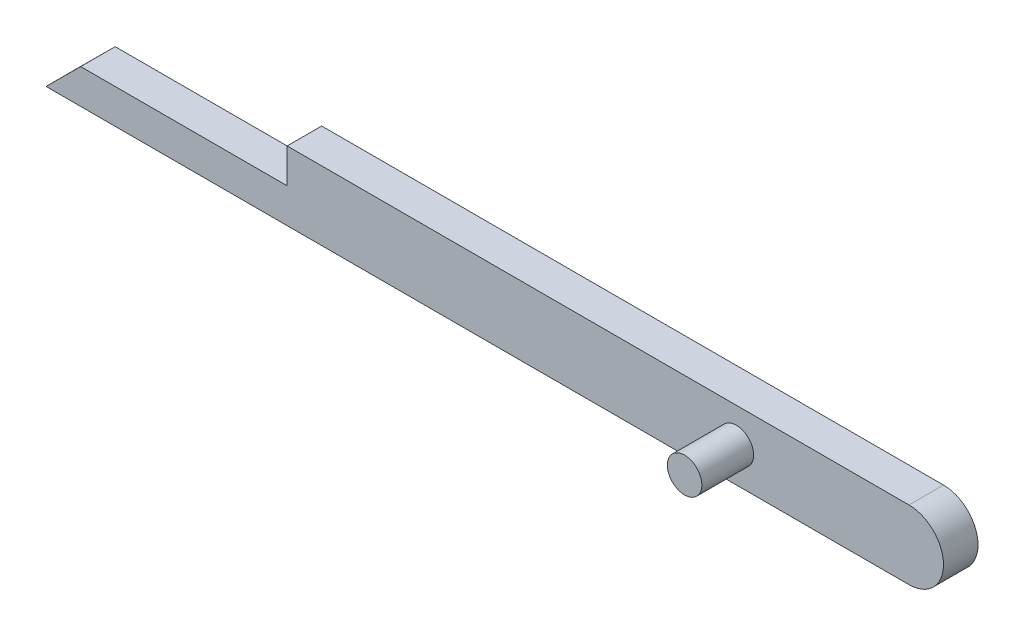
ISO-10303-21;
HEADER;
FILE_DESCRIPTION(('STEP AP214'),'2;1');
FILE_NAME('part.step','',(''),(''),'','','');
FILE_SCHEMA(('AUTOMOTIVE_DESIGN { 1 0 10303 214 1 1 1 1 }'));
ENDSEC;
DATA;
#1=APPLICATION_CONTEXT('core data for automotive mechanical design processes');
#2=APPLICATION_PROTOCOL_DEFINITION('international standard','automotive_design',2000,#1);
#3=PRODUCT_CONTEXT('',#1,'mechanical');
#4=PRODUCT('Part','Part','',(#3));
#5=PRODUCT_RELATED_PRODUCT_CATEGORY('part','',(#4));
#6=PRODUCT_DEFINITION_FORMATION('','',#4);
#7=PRODUCT_DEFINITION_CONTEXT('part definition',#1,'design');
#8=PRODUCT_DEFINITION('design','',#6,#7);
#9=PRODUCT_DEFINITION_SHAPE('','',#8);
#10=(LENGTH_UNIT() NAMED_UNIT(*) SI_UNIT(.MILLI.,.METRE.));
#11=(NAMED_UNIT(*) PLANE_ANGLE_UNIT() SI_UNIT($,.RADIAN.));
#12=(NAMED_UNIT(*) SI_UNIT($,.STERADIAN.) SOLID_ANGLE_UNIT());
#13=UNCERTAINTY_MEASURE_WITH_UNIT(LENGTH_MEASURE(1.E-05),#10,'distance_accuracy_value','');
#14=(GEOMETRIC_REPRESENTATION_CONTEXT(3) GLOBAL_UNCERTAINTY_ASSIGNED_CONTEXT((#13)) GLOBAL_UNIT_ASSIGNED_CONTEXT((#10,
#11,#12)) REPRESENTATION_CONTEXT('',''));
#15=CARTESIAN_POINT('',(0.,0.,0.));
#16=DIRECTION('',(0.,0.,1.));
#17=DIRECTION('',(1.,0.,0.));
#18=AXIS2_PLACEMENT_3D('',#15,#16,#17);
#19=CARTESIAN_POINT('',(250.,0.,20.));
#20=DIRECTION('',(0.,0.,1.));
#21=DIRECTION('',(1.,0.,0.));
#22=AXIS2_PLACEMENT_3D('',#19,#20,#21);
#23=PLANE('',#22);
#24=CARTESIAN_POINT('',(250.,0.,20.));
#25=DIRECTION('',(0.,0.,1.));
#26=DIRECTION('',(1.,0.,0.));
#27=AXIS2_PLACEMENT_3D('',#24,#25,#26);
#28=CIRCLE('',#27,20.);
#29=CARTESIAN_POINT('',(250.,-19.9999999999999,20.));
#30=VERTEX_POINT('',#29);
#31=CARTESIAN_POINT('',(250.,20.0000000000001,20.));
#32=VERTEX_POINT('',#31);
#33=EDGE_CURVE('E129',#30,#32,#28,.T.);
#34=ORIENTED_EDGE('',*,*,#33,.T.);
#35=DIRECTION('',(-1.,0.,0.));
#36=VECTOR('',#35,1.);
#37=CARTESIAN_POINT('',(-110.283225041906,20.,20.));
#38=LINE('',#37,#36);
#39=CARTESIAN_POINT('',(-110.283225041906,20.,20.));
#40=VERTEX_POINT('',#39);
#41=EDGE_CURVE('E87',#32,#40,#38,.T.);
#42=ORIENTED_EDGE('',*,*,#41,.T.);
#43=DIRECTION('',(0.,-1.,0.));
#44=VECTOR('',#43,1.);
#45=CARTESIAN_POINT('',(-110.283225041906,0.,20.));
#46=LINE('',#45,#44);
#47=CARTESIAN_POINT('',(-110.283225041906,0.,20.));
#48=VERTEX_POINT('',#47);
#49=EDGE_CURVE('E100',#40,#48,#46,.T.);
#50=ORIENTED_EDGE('',*,*,#49,.T.);
#51=DIRECTION('',(-1.,0.,0.));
#52=VECTOR('',#51,1.);
#53=CARTESIAN_POINT('',(-229.914228229182,0.,20.));
#54=LINE('',#53,#52);
#55=CARTESIAN_POINT('',(-229.914228229182,0.,20.));
#56=VERTEX_POINT('',#55);
#57=EDGE_CURVE('E94',#48,#56,#54,.T.);
#58=ORIENTED_EDGE('',*,*,#57,.T.);
#59=DIRECTION('',(-0.708618159740935,-0.705592165266431,0.));
#60=VECTOR('',#59,1.);
#61=CARTESIAN_POINT('',(-229.914228229182,0.,20.));
#62=LINE('',#61,#60);
#63=CARTESIAN_POINT('',(-250.,-20.,20.));
#64=VERTEX_POINT('',#63);
#65=EDGE_CURVE('E98',#56,#64,#62,.T.);
#66=ORIENTED_EDGE('',*,*,#65,.T.);
#67=DIRECTION('',(1.,0.,0.));
#68=VECTOR('',#67,1.);
#69=CARTESIAN_POINT('',(-250.,-20.,20.));
#70=LINE('',#69,#68);
#71=EDGE_CURVE('E50',#64,#30,#70,.T.);
#72=ORIENTED_EDGE('',*,*,#71,.T.);
#73=EDGE_LOOP('',(#34,#42,#50,#58,#66,#72));
#74=FACE_BOUND('',#73,.T.);
#75=CARTESIAN_POINT('',(150.,0.,20.));
#76=DIRECTION('',(0.,0.,1.));
#77=DIRECTION('',(1.,0.,0.));
#78=AXIS2_PLACEMENT_3D('',#75,#76,#77);
#79=CIRCLE('',#78,10.);
#80=CARTESIAN_POINT('',(160.,0.,20.));
#81=VERTEX_POINT('',#80);
#82=EDGE_CURVE('E122',#81,#81,#79,.T.);
#83=ORIENTED_EDGE('',*,*,#82,.F.);
#84=EDGE_LOOP('',(#83));
#85=FACE_BOUND('',#84,.T.);
#86=ADVANCED_FACE('F33',(#74,#85),#23,.T.);
#87=CARTESIAN_POINT('',(250.,0.,0.));
#88=DIRECTION('',(0.,0.,1.));
#89=DIRECTION('',(1.,0.,0.));
#90=AXIS2_PLACEMENT_3D('',#87,#88,#89);
#91=PLANE('',#90);
#92=CARTESIAN_POINT('',(250.,0.,0.));
#93=DIRECTION('',(0.,0.,1.));
#94=DIRECTION('',(1.,0.,0.));
#95=AXIS2_PLACEMENT_3D('',#92,#93,#94);
#96=CIRCLE('',#95,20.);
#97=CARTESIAN_POINT('',(250.,-19.9999999999999,0.));
#98=VERTEX_POINT('',#97);
#99=CARTESIAN_POINT('',(250.,20.0000000000001,0.));
#100=VERTEX_POINT('',#99);
#101=EDGE_CURVE('E118',#98,#100,#96,.T.);
#102=ORIENTED_EDGE('',*,*,#101,.F.);
#103=DIRECTION('',(1.,0.,0.));
#104=VECTOR('',#103,1.);
#105=CARTESIAN_POINT('',(-250.,-20.,0.));
#106=LINE('',#105,#104);
#107=CARTESIAN_POINT('',(-250.,-20.,0.));
#108=VERTEX_POINT('',#107);
#109=EDGE_CURVE('E79',#108,#98,#106,.T.);
#110=ORIENTED_EDGE('',*,*,#109,.F.);
#111=DIRECTION('',(-0.708618159740935,-0.705592165266431,0.));
#112=VECTOR('',#111,1.);
#113=CARTESIAN_POINT('',(-229.914228229182,0.,0.));
#114=LINE('',#113,#112);
#115=CARTESIAN_POINT('',(-229.914228229182,0.,0.));
#116=VERTEX_POINT('',#115);
#117=EDGE_CURVE('E73',#116,#108,#114,.T.);
#118=ORIENTED_EDGE('',*,*,#117,.F.);
#119=DIRECTION('',(-1.,0.,0.));
#120=VECTOR('',#119,1.);
#121=CARTESIAN_POINT('',(-229.914228229182,0.,0.));
#122=LINE('',#121,#120);
#123=CARTESIAN_POINT('',(-110.283225041906,0.,0.));
#124=VERTEX_POINT('',#123);
#125=EDGE_CURVE('E108',#124,#116,#122,.T.);
#126=ORIENTED_EDGE('',*,*,#125,.F.);
#127=DIRECTION('',(0.,-1.,0.));
#128=VECTOR('',#127,1.);
#129=CARTESIAN_POINT('',(-110.283225041906,0.,0.));
#130=LINE('',#129,#128);
#131=CARTESIAN_POINT('',(-110.283225041906,20.,0.));
#132=VERTEX_POINT('',#131);
#133=EDGE_CURVE('E124',#132,#124,#130,.T.);
#134=ORIENTED_EDGE('',*,*,#133,.F.);
#135=DIRECTION('',(-1.,0.,0.));
#136=VECTOR('',#135,1.);
#137=CARTESIAN_POINT('',(-110.283225041906,20.,0.));
#138=LINE('',#137,#136);
#139=EDGE_CURVE('E121',#100,#132,#138,.T.);
#140=ORIENTED_EDGE('',*,*,#139,.F.);
#141=EDGE_LOOP('',(#102,#110,#118,#126,#134,#140));
#142=FACE_BOUND('',#141,.T.);
#143=ADVANCED_FACE('F138',(#142),#91,.F.);
#144=CARTESIAN_POINT('',(250.,0.,20.));
#145=DIRECTION('',(0.,0.,-1.));
#146=DIRECTION('',(-1.,0.,0.));
#147=AXIS2_PLACEMENT_3D('',#144,#145,#146);
#148=CYLINDRICAL_SURFACE('',#147,20.);
#149=ORIENTED_EDGE('',*,*,#101,.T.);
#150=DIRECTION('',(0.,0.,-1.));
#151=VECTOR('',#150,1.);
#152=CARTESIAN_POINT('',(250.,20.0000000000001,20.));
#153=LINE('',#152,#151);
#154=EDGE_CURVE('E11',#32,#100,#153,.T.);
#155=ORIENTED_EDGE('',*,*,#154,.F.);
#156=ORIENTED_EDGE('',*,*,#33,.F.);
#157=DIRECTION('',(0.,0.,-1.));
#158=VECTOR('',#157,1.);
#159=CARTESIAN_POINT('',(250.,-19.9999999999999,20.));
#160=LINE('',#159,#158);
#161=EDGE_CURVE('E114',#30,#98,#160,.T.);
#162=ORIENTED_EDGE('',*,*,#161,.T.);
#163=EDGE_LOOP('',(#149,#155,#156,#162));
#164=FACE_BOUND('',#163,.T.);
#165=ADVANCED_FACE('F35',(#164),#148,.T.);
#166=CARTESIAN_POINT('',(-110.283225041906,20.,20.));
#167=DIRECTION('',(0.,-1.,0.));
#168=DIRECTION('',(1.,0.,0.));
#169=AXIS2_PLACEMENT_3D('',#166,#167,#168);
#170=PLANE('',#169);
#171=ORIENTED_EDGE('',*,*,#139,.T.);
#172=DIRECTION('',(0.,0.,-1.));
#173=VECTOR('',#172,1.);
#174=CARTESIAN_POINT('',(-110.283225041906,20.,20.));
#175=LINE('',#174,#173);
#176=EDGE_CURVE('E42',#40,#132,#175,.T.);
#177=ORIENTED_EDGE('',*,*,#176,.F.);
#178=ORIENTED_EDGE('',*,*,#41,.F.);
#179=ORIENTED_EDGE('',*,*,#154,.T.);
#180=EDGE_LOOP('',(#171,#177,#178,#179));
#181=FACE_BOUND('',#180,.T.);
#182=ADVANCED_FACE('F214',(#181),#170,.F.);
#183=CARTESIAN_POINT('',(-110.283225041906,0.,20.));
#184=DIRECTION('',(1.,0.,0.));
#185=DIRECTION('',(0.,0.,-1.));
#186=AXIS2_PLACEMENT_3D('',#183,#184,#185);
#187=PLANE('',#186);
#188=ORIENTED_EDGE('',*,*,#133,.T.);
#189=DIRECTION('',(0.,0.,-1.));
#190=VECTOR('',#189,1.);
#191=CARTESIAN_POINT('',(-110.283225041906,0.,20.));
#192=LINE('',#191,#190);
#193=EDGE_CURVE('E109',#48,#124,#192,.T.);
#194=ORIENTED_EDGE('',*,*,#193,.F.);
#195=ORIENTED_EDGE('',*,*,#49,.F.);
#196=ORIENTED_EDGE('',*,*,#176,.T.);
#197=EDGE_LOOP('',(#188,#194,#195,#196));
#198=FACE_BOUND('',#197,.T.);
#199=ADVANCED_FACE('F135',(#198),#187,.F.);
#200=CARTESIAN_POINT('',(-229.914228229182,0.,20.));
#201=DIRECTION('',(0.,-1.,0.));
#202=DIRECTION('',(0.,0.,-1.));
#203=AXIS2_PLACEMENT_3D('',#200,#201,#202);
#204=PLANE('',#203);
#205=ORIENTED_EDGE('',*,*,#125,.T.);
#206=DIRECTION('',(0.,0.,-1.));
#207=VECTOR('',#206,1.);
#208=CARTESIAN_POINT('',(-229.914228229182,0.,20.));
#209=LINE('',#208,#207);
#210=EDGE_CURVE('E105',#56,#116,#209,.T.);
#211=ORIENTED_EDGE('',*,*,#210,.F.);
#212=ORIENTED_EDGE('',*,*,#57,.F.);
#213=ORIENTED_EDGE('',*,*,#193,.T.);
#214=EDGE_LOOP('',(#205,#211,#212,#213));
#215=FACE_BOUND('',#214,.T.);
#216=ADVANCED_FACE('F106',(#215),#204,.F.);
#217=CARTESIAN_POINT('',(-229.914228229182,0.,20.));
#218=DIRECTION('',(0.705592165266431,-0.708618159740935,0.));
#219=DIRECTION('',(0.708618159740935,0.705592165266431,0.));
#220=AXIS2_PLACEMENT_3D('',#217,#218,#219);
#221=PLANE('',#220);
#222=ORIENTED_EDGE('',*,*,#117,.T.);
#223=DIRECTION('',(0.,0.,-1.));
#224=VECTOR('',#223,1.);
#225=CARTESIAN_POINT('',(-250.,-20.,20.));
#226=LINE('',#225,#224);
#227=EDGE_CURVE('E110',#64,#108,#226,.T.);
#228=ORIENTED_EDGE('',*,*,#227,.F.);
#229=ORIENTED_EDGE('',*,*,#65,.F.);
#230=ORIENTED_EDGE('',*,*,#210,.T.);
#231=EDGE_LOOP('',(#222,#228,#229,#230));
#232=FACE_BOUND('',#231,.T.);
#233=ADVANCED_FACE('F112',(#232),#221,.F.);
#234=CARTESIAN_POINT('',(-250.,-20.,20.));
#235=DIRECTION('',(0.,1.,0.));
#236=DIRECTION('',(-1.,0.,0.));
#237=AXIS2_PLACEMENT_3D('',#234,#235,#236);
#238=PLANE('',#237);
#239=ORIENTED_EDGE('',*,*,#109,.T.);
#240=ORIENTED_EDGE('',*,*,#161,.F.);
#241=ORIENTED_EDGE('',*,*,#71,.F.);
#242=ORIENTED_EDGE('',*,*,#227,.T.);
#243=EDGE_LOOP('',(#239,#240,#241,#242));
#244=FACE_BOUND('',#243,.T.);
#245=ADVANCED_FACE('F142',(#244),#238,.F.);
#246=CARTESIAN_POINT('',(150.,0.,50.));
#247=DIRECTION('',(0.,0.,-1.));
#248=DIRECTION('',(-1.,0.,0.));
#249=AXIS2_PLACEMENT_3D('',#246,#247,#248);
#250=CYLINDRICAL_SURFACE('',#249,10.);
#251=ORIENTED_EDGE('',*,*,#82,.T.);
#252=EDGE_LOOP('',(#251));
#253=FACE_BOUND('',#252,.T.);
#254=CARTESIAN_POINT('',(150.,0.,50.));
#255=DIRECTION('',(0.,0.,1.));
#256=DIRECTION('',(1.,0.,0.));
#257=AXIS2_PLACEMENT_3D('',#254,#255,#256);
#258=CIRCLE('',#257,10.);
#259=CARTESIAN_POINT('',(160.,0.,50.));
#260=VERTEX_POINT('',#259);
#261=EDGE_CURVE('E167',#260,#260,#258,.T.);
#262=ORIENTED_EDGE('',*,*,#261,.F.);
#263=EDGE_LOOP('',(#262));
#264=FACE_BOUND('',#263,.T.);
#265=ADVANCED_FACE('F144',(#253,#264),#250,.T.);
#266=CARTESIAN_POINT('',(150.,0.,50.));
#267=DIRECTION('',(0.,0.,1.));
#268=DIRECTION('',(1.,0.,0.));
#269=AXIS2_PLACEMENT_3D('',#266,#267,#268);
#270=PLANE('',#269);
#271=ORIENTED_EDGE('',*,*,#261,.T.);
#272=EDGE_LOOP('',(#271));
#273=FACE_BOUND('',#272,.T.);
#274=ADVANCED_FACE('F150',(#273),#270,.T.);
#275=CLOSED_SHELL('',(#86,#143,#165,#182,#199,#216,#233,#245,#265,#274));
#276=MANIFOLD_SOLID_BREP('B2',#275);
#277=ADVANCED_BREP_SHAPE_REPRESENTATION('',(#18,#276),#14);
#278=SHAPE_DEFINITION_REPRESENTATION(#9,#277);
ENDSEC;
END-ISO-10303-21;
